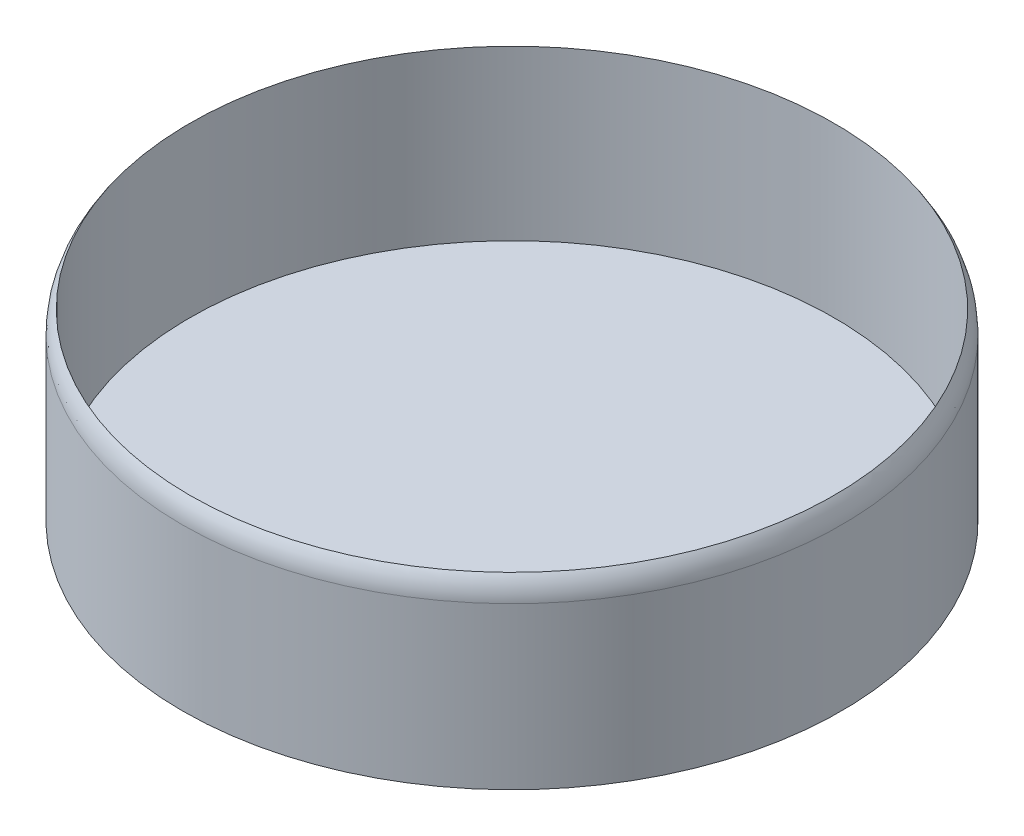
ISO-10303-21;
HEADER;
FILE_DESCRIPTION(('STEP AP214'),'2;1');
FILE_NAME('part.step','',(''),(''),'','','');
FILE_SCHEMA(('AUTOMOTIVE_DESIGN { 1 0 10303 214 1 1 1 1 }'));
ENDSEC;
DATA;
#1=APPLICATION_CONTEXT('core data for automotive mechanical design processes');
#2=APPLICATION_PROTOCOL_DEFINITION('international standard','automotive_design',2000,#1);
#3=PRODUCT_CONTEXT('',#1,'mechanical');
#4=PRODUCT('Part','Part','',(#3));
#5=PRODUCT_RELATED_PRODUCT_CATEGORY('part','',(#4));
#6=PRODUCT_DEFINITION_FORMATION('','',#4);
#7=PRODUCT_DEFINITION_CONTEXT('part definition',#1,'design');
#8=PRODUCT_DEFINITION('design','',#6,#7);
#9=PRODUCT_DEFINITION_SHAPE('','',#8);
#10=(LENGTH_UNIT() NAMED_UNIT(*) SI_UNIT(.MILLI.,.METRE.));
#11=(NAMED_UNIT(*) PLANE_ANGLE_UNIT() SI_UNIT($,.RADIAN.));
#12=(NAMED_UNIT(*) SI_UNIT($,.STERADIAN.) SOLID_ANGLE_UNIT());
#13=UNCERTAINTY_MEASURE_WITH_UNIT(LENGTH_MEASURE(1.E-05),#10,'distance_accuracy_value','');
#14=(GEOMETRIC_REPRESENTATION_CONTEXT(3) GLOBAL_UNCERTAINTY_ASSIGNED_CONTEXT((#13)) GLOBAL_UNIT_ASSIGNED_CONTEXT((#10,
#11,#12)) REPRESENTATION_CONTEXT('',''));
#15=CARTESIAN_POINT('',(0.,0.,0.));
#16=DIRECTION('',(0.,0.,1.));
#17=DIRECTION('',(1.,0.,0.));
#18=AXIS2_PLACEMENT_3D('',#15,#16,#17);
#19=CARTESIAN_POINT('',(0.,100.,0.));
#20=DIRECTION('',(0.,-1.,0.));
#21=DIRECTION('',(0.,0.,-1.));
#22=AXIS2_PLACEMENT_3D('',#19,#20,#21);
#23=CYLINDRICAL_SURFACE('',#22,90.);
#24=CARTESIAN_POINT('',(0.,44.,0.));
#25=DIRECTION('',(0.,1.,0.));
#26=DIRECTION('',(0.,0.,1.));
#27=AXIS2_PLACEMENT_3D('',#24,#25,#26);
#28=CIRCLE('',#27,90.);
#29=CARTESIAN_POINT('',(0.,44.,90.));
#30=VERTEX_POINT('',#29);
#31=EDGE_CURVE('E11',#30,#30,#28,.F.);
#32=ORIENTED_EDGE('',*,*,#31,.T.);
#33=EDGE_LOOP('',(#32));
#34=FACE_BOUND('',#33,.T.);
#35=CARTESIAN_POINT('',(0.,0.,0.));
#36=DIRECTION('',(0.,1.,0.));
#37=DIRECTION('',(0.,0.,1.));
#38=AXIS2_PLACEMENT_3D('',#35,#36,#37);
#39=CIRCLE('',#38,90.);
#40=CARTESIAN_POINT('',(0.,0.,90.));
#41=VERTEX_POINT('',#40);
#42=EDGE_CURVE('E45',#41,#41,#39,.T.);
#43=ORIENTED_EDGE('',*,*,#42,.T.);
#44=EDGE_LOOP('',(#43));
#45=FACE_BOUND('',#44,.T.);
#46=ADVANCED_FACE('F38',(#34,#45),#23,.T.);
#47=CARTESIAN_POINT('',(0.,0.,0.));
#48=DIRECTION('',(0.,1.,0.));
#49=DIRECTION('',(0.,0.,1.));
#50=AXIS2_PLACEMENT_3D('',#47,#48,#49);
#51=PLANE('',#50);
#52=ORIENTED_EDGE('',*,*,#42,.F.);
#53=EDGE_LOOP('',(#52));
#54=FACE_BOUND('',#53,.T.);
#55=ADVANCED_FACE('F63',(#54),#51,.F.);
#56=CARTESIAN_POINT('',(0.,100.,0.));
#57=DIRECTION('',(0.,-1.,0.));
#58=DIRECTION('',(0.,0.,-1.));
#59=AXIS2_PLACEMENT_3D('',#56,#57,#58);
#60=CYLINDRICAL_SURFACE('',#59,88.);
#61=CARTESIAN_POINT('',(0.,4.,0.));
#62=DIRECTION('',(0.,1.,0.));
#63=DIRECTION('',(0.,0.,1.));
#64=AXIS2_PLACEMENT_3D('',#61,#62,#63);
#65=CIRCLE('',#64,88.);
#66=CARTESIAN_POINT('',(0.,4.,88.));
#67=VERTEX_POINT('',#66);
#68=EDGE_CURVE('E55',#67,#67,#65,.T.);
#69=ORIENTED_EDGE('',*,*,#68,.F.);
#70=EDGE_LOOP('',(#69));
#71=FACE_BOUND('',#70,.T.);
#72=CARTESIAN_POINT('',(0.,50.,0.));
#73=DIRECTION('',(0.,1.,0.));
#74=DIRECTION('',(0.,0.,1.));
#75=AXIS2_PLACEMENT_3D('',#72,#73,#74);
#76=CIRCLE('',#75,88.);
#77=CARTESIAN_POINT('',(0.,50.,88.));
#78=VERTEX_POINT('',#77);
#79=EDGE_CURVE('E49',#78,#78,#76,.F.);
#80=ORIENTED_EDGE('',*,*,#79,.F.);
#81=EDGE_LOOP('',(#80));
#82=FACE_BOUND('',#81,.T.);
#83=ADVANCED_FACE('F72',(#71,#82),#60,.F.);
#84=CARTESIAN_POINT('',(0.,44.,0.));
#85=DIRECTION('',(0.,1.,0.));
#86=DIRECTION('',(0.,0.,1.));
#87=AXIS2_PLACEMENT_3D('',#84,#85,#86);
#88=TOROIDAL_SURFACE('',#87,80.,10.);
#89=ORIENTED_EDGE('',*,*,#31,.F.);
#90=EDGE_LOOP('',(#89));
#91=FACE_BOUND('',#90,.T.);
#92=ORIENTED_EDGE('',*,*,#79,.T.);
#93=EDGE_LOOP('',(#92));
#94=FACE_BOUND('',#93,.T.);
#95=ADVANCED_FACE('F40',(#91,#94),#88,.T.);
#96=CARTESIAN_POINT('',(0.,4.,0.));
#97=DIRECTION('',(0.,1.,0.));
#98=DIRECTION('',(0.,0.,1.));
#99=AXIS2_PLACEMENT_3D('',#96,#97,#98);
#100=PLANE('',#99);
#101=ORIENTED_EDGE('',*,*,#68,.T.);
#102=EDGE_LOOP('',(#101));
#103=FACE_BOUND('',#102,.T.);
#104=ADVANCED_FACE('F89',(#103),#100,.T.);
#105=CLOSED_SHELL('',(#46,#55,#83,#95,#104));
#106=MANIFOLD_SOLID_BREP('B2',#105);
#107=ADVANCED_BREP_SHAPE_REPRESENTATION('',(#18,#106),#14);
#108=SHAPE_DEFINITION_REPRESENTATION(#9,#107);
ENDSEC;
END-ISO-10303-21;
